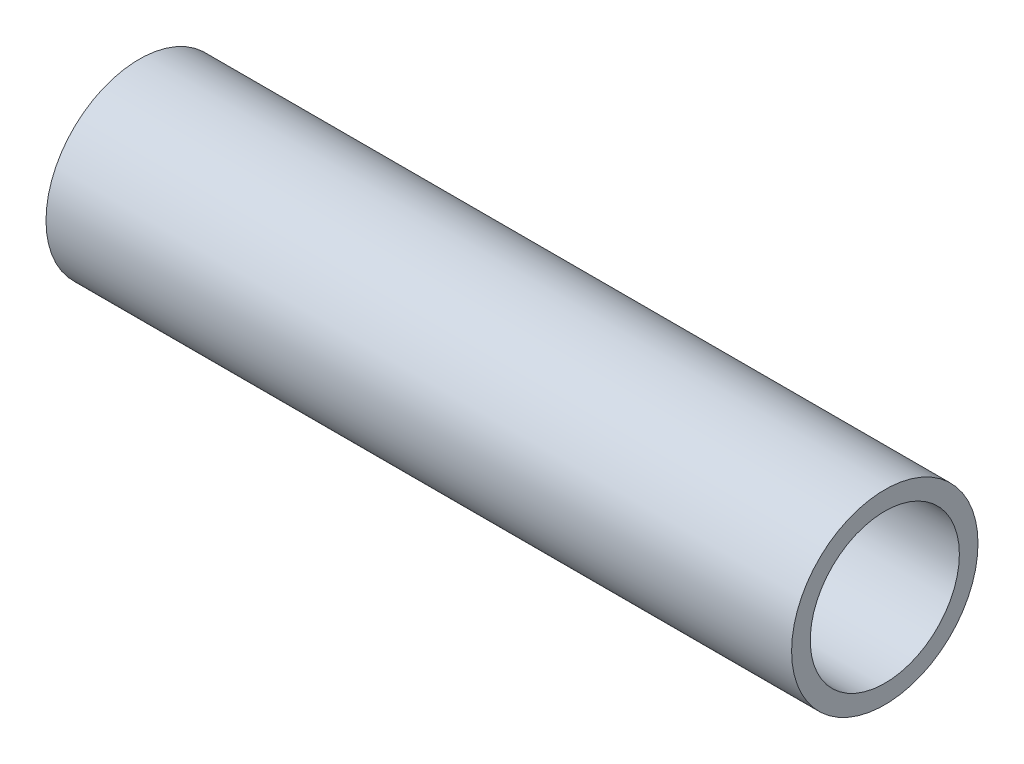
ISO-10303-21;
HEADER;
FILE_DESCRIPTION(('STEP AP214'),'2;1');
FILE_NAME('part.step','',(''),(''),'','','');
FILE_SCHEMA(('AUTOMOTIVE_DESIGN { 1 0 10303 214 1 1 1 1 }'));
ENDSEC;
DATA;
#1=APPLICATION_CONTEXT('core data for automotive mechanical design processes');
#2=APPLICATION_PROTOCOL_DEFINITION('international standard','automotive_design',2000,#1);
#3=PRODUCT_CONTEXT('',#1,'mechanical');
#4=PRODUCT('Part','Part','',(#3));
#5=PRODUCT_RELATED_PRODUCT_CATEGORY('part','',(#4));
#6=PRODUCT_DEFINITION_FORMATION('','',#4);
#7=PRODUCT_DEFINITION_CONTEXT('part definition',#1,'design');
#8=PRODUCT_DEFINITION('design','',#6,#7);
#9=PRODUCT_DEFINITION_SHAPE('','',#8);
#10=(LENGTH_UNIT() NAMED_UNIT(*) SI_UNIT(.MILLI.,.METRE.));
#11=(NAMED_UNIT(*) PLANE_ANGLE_UNIT() SI_UNIT($,.RADIAN.));
#12=(NAMED_UNIT(*) SI_UNIT($,.STERADIAN.) SOLID_ANGLE_UNIT());
#13=UNCERTAINTY_MEASURE_WITH_UNIT(LENGTH_MEASURE(1.E-05),#10,'distance_accuracy_value','');
#14=(GEOMETRIC_REPRESENTATION_CONTEXT(3) GLOBAL_UNCERTAINTY_ASSIGNED_CONTEXT((#13)) GLOBAL_UNIT_ASSIGNED_CONTEXT((#10,
#11,#12)) REPRESENTATION_CONTEXT('',''));
#15=CARTESIAN_POINT('',(0.,0.,0.));
#16=DIRECTION('',(0.,0.,1.));
#17=DIRECTION('',(1.,0.,0.));
#18=AXIS2_PLACEMENT_3D('',#15,#16,#17);
#19=CARTESIAN_POINT('',(40.,0.,0.));
#20=DIRECTION('',(1.,0.,0.));
#21=DIRECTION('',(0.,0.,-1.));
#22=AXIS2_PLACEMENT_3D('',#19,#20,#21);
#23=PLANE('',#22);
#24=CARTESIAN_POINT('',(40.,0.,0.));
#25=DIRECTION('',(1.,0.,0.));
#26=DIRECTION('',(0.,0.,-1.));
#27=AXIS2_PLACEMENT_3D('',#24,#25,#26);
#28=CIRCLE('',#27,5.);
#29=CARTESIAN_POINT('',(40.,0.,-5.));
#30=VERTEX_POINT('',#29);
#31=EDGE_CURVE('E10',#30,#30,#28,.T.);
#32=ORIENTED_EDGE('',*,*,#31,.T.);
#33=EDGE_LOOP('',(#32));
#34=FACE_BOUND('',#33,.T.);
#35=CARTESIAN_POINT('',(40.,0.,0.));
#36=DIRECTION('',(1.,0.,0.));
#37=DIRECTION('',(0.,0.,-1.));
#38=AXIS2_PLACEMENT_3D('',#35,#36,#37);
#39=CIRCLE('',#38,4.);
#40=CARTESIAN_POINT('',(40.,0.,-4.));
#41=VERTEX_POINT('',#40);
#42=EDGE_CURVE('E43',#41,#41,#39,.T.);
#43=ORIENTED_EDGE('',*,*,#42,.F.);
#44=EDGE_LOOP('',(#43));
#45=FACE_BOUND('',#44,.T.);
#46=ADVANCED_FACE('F32',(#34,#45),#23,.T.);
#47=CARTESIAN_POINT('',(0.,0.,0.));
#48=DIRECTION('',(1.,0.,0.));
#49=DIRECTION('',(0.,0.,-1.));
#50=AXIS2_PLACEMENT_3D('',#47,#48,#49);
#51=PLANE('',#50);
#52=CARTESIAN_POINT('',(0.,0.,0.));
#53=DIRECTION('',(1.,0.,0.));
#54=DIRECTION('',(0.,0.,-1.));
#55=AXIS2_PLACEMENT_3D('',#52,#53,#54);
#56=CIRCLE('',#55,5.);
#57=CARTESIAN_POINT('',(0.,0.,-5.));
#58=VERTEX_POINT('',#57);
#59=EDGE_CURVE('E36',#58,#58,#56,.T.);
#60=ORIENTED_EDGE('',*,*,#59,.F.);
#61=EDGE_LOOP('',(#60));
#62=FACE_BOUND('',#61,.T.);
#63=CARTESIAN_POINT('',(0.,0.,0.));
#64=DIRECTION('',(1.,0.,0.));
#65=DIRECTION('',(0.,0.,-1.));
#66=AXIS2_PLACEMENT_3D('',#63,#64,#65);
#67=CIRCLE('',#66,4.);
#68=CARTESIAN_POINT('',(0.,0.,-4.));
#69=VERTEX_POINT('',#68);
#70=EDGE_CURVE('E45',#69,#69,#67,.T.);
#71=ORIENTED_EDGE('',*,*,#70,.T.);
#72=EDGE_LOOP('',(#71));
#73=FACE_BOUND('',#72,.T.);
#74=ADVANCED_FACE('F55',(#62,#73),#51,.F.);
#75=CARTESIAN_POINT('',(40.,0.,0.));
#76=DIRECTION('',(-1.,0.,0.));
#77=DIRECTION('',(0.,0.,1.));
#78=AXIS2_PLACEMENT_3D('',#75,#76,#77);
#79=CYLINDRICAL_SURFACE('',#78,5.);
#80=ORIENTED_EDGE('',*,*,#31,.F.);
#81=EDGE_LOOP('',(#80));
#82=FACE_BOUND('',#81,.T.);
#83=ORIENTED_EDGE('',*,*,#59,.T.);
#84=EDGE_LOOP('',(#83));
#85=FACE_BOUND('',#84,.T.);
#86=ADVANCED_FACE('F34',(#82,#85),#79,.T.);
#87=CARTESIAN_POINT('',(40.,0.,0.));
#88=DIRECTION('',(-1.,0.,0.));
#89=DIRECTION('',(0.,0.,1.));
#90=AXIS2_PLACEMENT_3D('',#87,#88,#89);
#91=CYLINDRICAL_SURFACE('',#90,4.);
#92=ORIENTED_EDGE('',*,*,#42,.T.);
#93=EDGE_LOOP('',(#92));
#94=FACE_BOUND('',#93,.T.);
#95=ORIENTED_EDGE('',*,*,#70,.F.);
#96=EDGE_LOOP('',(#95));
#97=FACE_BOUND('',#96,.T.);
#98=ADVANCED_FACE('F51',(#94,#97),#91,.F.);
#99=CLOSED_SHELL('',(#46,#74,#86,#98));
#100=MANIFOLD_SOLID_BREP('B2',#99);
#101=ADVANCED_BREP_SHAPE_REPRESENTATION('',(#18,#100),#14);
#102=SHAPE_DEFINITION_REPRESENTATION(#9,#101);
ENDSEC;
END-ISO-10303-21;
